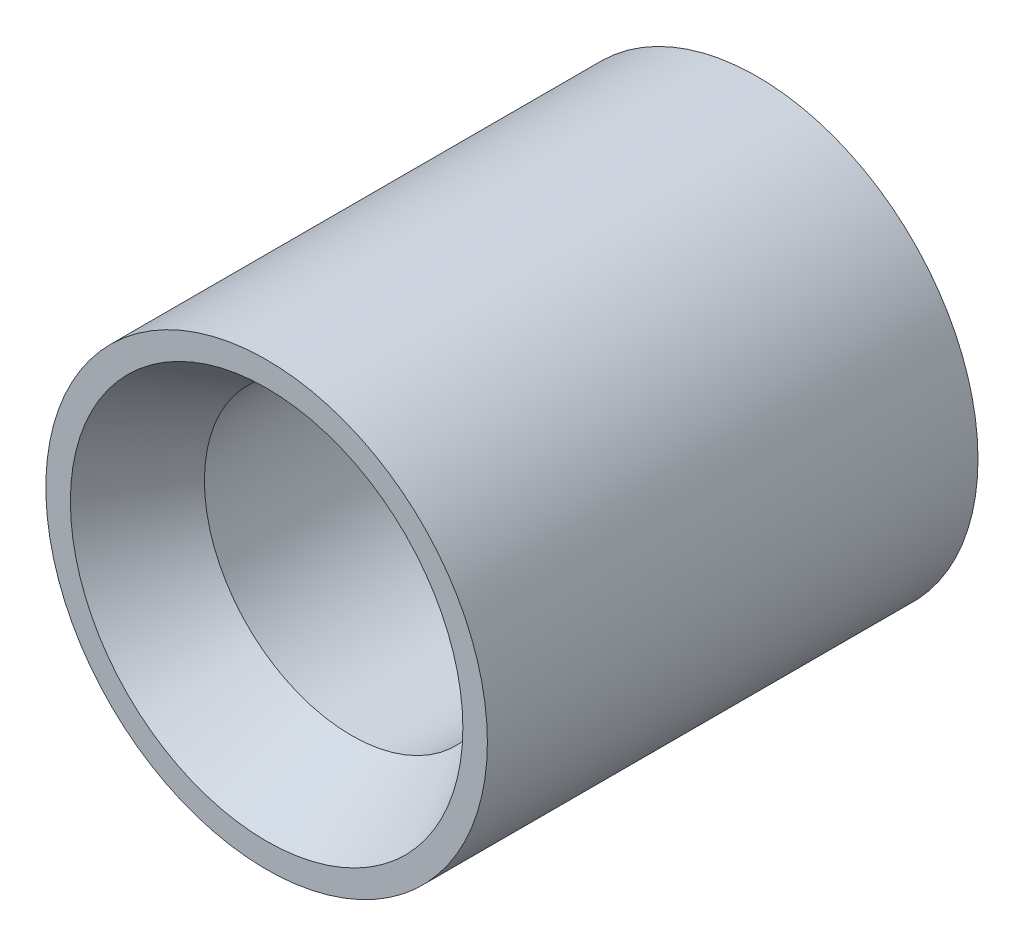
ISO-10303-21;
HEADER;
FILE_DESCRIPTION(('STEP AP214'),'2;1');
FILE_NAME('part.step','',(''),(''),'','','');
FILE_SCHEMA(('AUTOMOTIVE_DESIGN { 1 0 10303 214 1 1 1 1 }'));
ENDSEC;
DATA;
#1=APPLICATION_CONTEXT('core data for automotive mechanical design processes');
#2=APPLICATION_PROTOCOL_DEFINITION('international standard','automotive_design',2000,#1);
#3=PRODUCT_CONTEXT('',#1,'mechanical');
#4=PRODUCT('Part','Part','',(#3));
#5=PRODUCT_RELATED_PRODUCT_CATEGORY('part','',(#4));
#6=PRODUCT_DEFINITION_FORMATION('','',#4);
#7=PRODUCT_DEFINITION_CONTEXT('part definition',#1,'design');
#8=PRODUCT_DEFINITION('design','',#6,#7);
#9=PRODUCT_DEFINITION_SHAPE('','',#8);
#10=(LENGTH_UNIT() NAMED_UNIT(*) SI_UNIT(.MILLI.,.METRE.));
#11=(NAMED_UNIT(*) PLANE_ANGLE_UNIT() SI_UNIT($,.RADIAN.));
#12=(NAMED_UNIT(*) SI_UNIT($,.STERADIAN.) SOLID_ANGLE_UNIT());
#13=UNCERTAINTY_MEASURE_WITH_UNIT(LENGTH_MEASURE(1.E-05),#10,'distance_accuracy_value','');
#14=(GEOMETRIC_REPRESENTATION_CONTEXT(3) GLOBAL_UNCERTAINTY_ASSIGNED_CONTEXT((#13)) GLOBAL_UNIT_ASSIGNED_CONTEXT((#10,
#11,#12)) REPRESENTATION_CONTEXT('',''));
#15=CARTESIAN_POINT('',(0.,0.,0.));
#16=DIRECTION('',(0.,0.,1.));
#17=DIRECTION('',(1.,0.,0.));
#18=AXIS2_PLACEMENT_3D('',#15,#16,#17);
#19=CARTESIAN_POINT('',(0.,0.,10.));
#20=DIRECTION('',(0.,0.,1.));
#21=DIRECTION('',(1.,0.,0.));
#22=AXIS2_PLACEMENT_3D('',#19,#20,#21);
#23=PLANE('',#22);
#24=CARTESIAN_POINT('',(0.,0.,10.));
#25=DIRECTION('',(0.,0.,-1.));
#26=DIRECTION('',(-1.,0.,0.));
#27=AXIS2_PLACEMENT_3D('',#24,#25,#26);
#28=CIRCLE('',#27,4.);
#29=CARTESIAN_POINT('',(-4.,0.,10.));
#30=VERTEX_POINT('',#29);
#31=EDGE_CURVE('E66',#30,#30,#28,.T.);
#32=ORIENTED_EDGE('',*,*,#31,.T.);
#33=EDGE_LOOP('',(#32));
#34=FACE_BOUND('',#33,.T.);
#35=CARTESIAN_POINT('',(0.,0.,10.));
#36=DIRECTION('',(0.,0.,1.));
#37=DIRECTION('',(1.,0.,0.));
#38=AXIS2_PLACEMENT_3D('',#35,#36,#37);
#39=CIRCLE('',#38,4.5);
#40=CARTESIAN_POINT('',(4.5,0.,10.));
#41=VERTEX_POINT('',#40);
#42=EDGE_CURVE('E11',#41,#41,#39,.T.);
#43=ORIENTED_EDGE('',*,*,#42,.T.);
#44=EDGE_LOOP('',(#43));
#45=FACE_BOUND('',#44,.T.);
#46=ADVANCED_FACE('F46',(#34,#45),#23,.T.);
#47=CARTESIAN_POINT('',(0.,0.,0.));
#48=DIRECTION('',(0.,0.,1.));
#49=DIRECTION('',(1.,0.,0.));
#50=AXIS2_PLACEMENT_3D('',#47,#48,#49);
#51=PLANE('',#50);
#52=CARTESIAN_POINT('',(0.,0.,0.));
#53=DIRECTION('',(0.,0.,1.));
#54=DIRECTION('',(1.,0.,0.));
#55=AXIS2_PLACEMENT_3D('',#52,#53,#54);
#56=CIRCLE('',#55,4.5);
#57=CARTESIAN_POINT('',(4.5,0.,0.));
#58=VERTEX_POINT('',#57);
#59=EDGE_CURVE('E55',#58,#58,#56,.T.);
#60=ORIENTED_EDGE('',*,*,#59,.F.);
#61=EDGE_LOOP('',(#60));
#62=FACE_BOUND('',#61,.T.);
#63=CARTESIAN_POINT('',(0.,0.,0.));
#64=DIRECTION('',(0.,0.,1.));
#65=DIRECTION('',(1.,0.,0.));
#66=AXIS2_PLACEMENT_3D('',#63,#64,#65);
#67=CIRCLE('',#66,3.);
#68=CARTESIAN_POINT('',(3.,0.,0.));
#69=VERTEX_POINT('',#68);
#70=EDGE_CURVE('E61',#69,#69,#67,.T.);
#71=ORIENTED_EDGE('',*,*,#70,.T.);
#72=EDGE_LOOP('',(#71));
#73=FACE_BOUND('',#72,.T.);
#74=ADVANCED_FACE('F84',(#62,#73),#51,.F.);
#75=CARTESIAN_POINT('',(0.,0.,10.));
#76=DIRECTION('',(0.,0.,-1.));
#77=DIRECTION('',(-1.,0.,0.));
#78=AXIS2_PLACEMENT_3D('',#75,#76,#77);
#79=CYLINDRICAL_SURFACE('',#78,4.5);
#80=ORIENTED_EDGE('',*,*,#42,.F.);
#81=EDGE_LOOP('',(#80));
#82=FACE_BOUND('',#81,.T.);
#83=ORIENTED_EDGE('',*,*,#59,.T.);
#84=EDGE_LOOP('',(#83));
#85=FACE_BOUND('',#84,.T.);
#86=ADVANCED_FACE('F48',(#82,#85),#79,.T.);
#87=CARTESIAN_POINT('',(0.,0.,10.));
#88=DIRECTION('',(0.,0.,-1.));
#89=DIRECTION('',(-1.,0.,0.));
#90=AXIS2_PLACEMENT_3D('',#87,#88,#89);
#91=CYLINDRICAL_SURFACE('',#90,3.);
#92=CARTESIAN_POINT('',(0.,0.,8.2679491924311));
#93=DIRECTION('',(0.,0.,1.));
#94=DIRECTION('',(1.,0.,0.));
#95=AXIS2_PLACEMENT_3D('',#92,#93,#94);
#96=CIRCLE('',#95,3.);
#97=CARTESIAN_POINT('',(3.,0.,8.2679491924311));
#98=VERTEX_POINT('',#97);
#99=EDGE_CURVE('E50',#98,#98,#96,.F.);
#100=ORIENTED_EDGE('',*,*,#99,.F.);
#101=EDGE_LOOP('',(#100));
#102=FACE_BOUND('',#101,.T.);
#103=ORIENTED_EDGE('',*,*,#70,.F.);
#104=EDGE_LOOP('',(#103));
#105=FACE_BOUND('',#104,.T.);
#106=ADVANCED_FACE('F78',(#102,#105),#91,.F.);
#107=CARTESIAN_POINT('',(0.,0.,3.07179676972439));
#108=DIRECTION('',(0.,0.,1.));
#109=DIRECTION('',(1.,0.,0.));
#110=AXIS2_PLACEMENT_3D('',#107,#108,#109);
#111=CONICAL_SURFACE('',#110,0.,0.523598775598293);
#112=ORIENTED_EDGE('',*,*,#99,.T.);
#113=EDGE_LOOP('',(#112));
#114=FACE_BOUND('',#113,.T.);
#115=ORIENTED_EDGE('',*,*,#31,.F.);
#116=EDGE_LOOP('',(#115));
#117=FACE_BOUND('',#116,.T.);
#118=ADVANCED_FACE('F75',(#114,#117),#111,.F.);
#119=CLOSED_SHELL('',(#46,#74,#86,#106,#118));
#120=MANIFOLD_SOLID_BREP('B2',#119);
#121=ADVANCED_BREP_SHAPE_REPRESENTATION('',(#18,#120),#14);
#122=SHAPE_DEFINITION_REPRESENTATION(#9,#121);
ENDSEC;
END-ISO-10303-21;
